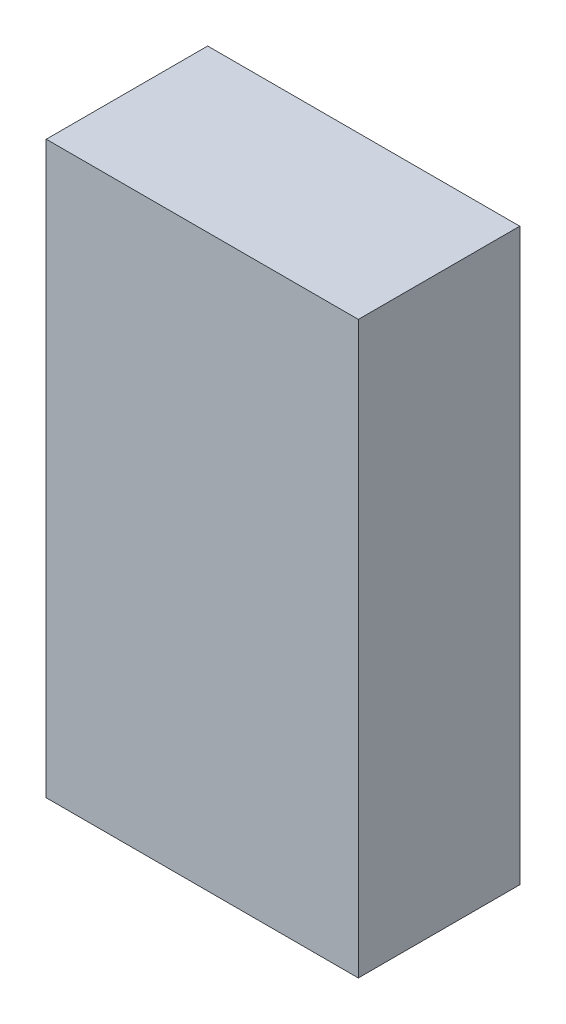
ISO-10303-21;
HEADER;
FILE_DESCRIPTION(('STEP AP214'),'2;1');
FILE_NAME('part.step','',(''),(''),'','','');
FILE_SCHEMA(('AUTOMOTIVE_DESIGN { 1 0 10303 214 1 1 1 1 }'));
ENDSEC;
DATA;
#1=APPLICATION_CONTEXT('core data for automotive mechanical design processes');
#2=APPLICATION_PROTOCOL_DEFINITION('international standard','automotive_design',2000,#1);
#3=PRODUCT_CONTEXT('',#1,'mechanical');
#4=PRODUCT('Part','Part','',(#3));
#5=PRODUCT_RELATED_PRODUCT_CATEGORY('part','',(#4));
#6=PRODUCT_DEFINITION_FORMATION('','',#4);
#7=PRODUCT_DEFINITION_CONTEXT('part definition',#1,'design');
#8=PRODUCT_DEFINITION('design','',#6,#7);
#9=PRODUCT_DEFINITION_SHAPE('','',#8);
#10=(LENGTH_UNIT() NAMED_UNIT(*) SI_UNIT(.MILLI.,.METRE.));
#11=(NAMED_UNIT(*) PLANE_ANGLE_UNIT() SI_UNIT($,.RADIAN.));
#12=(NAMED_UNIT(*) SI_UNIT($,.STERADIAN.) SOLID_ANGLE_UNIT());
#13=UNCERTAINTY_MEASURE_WITH_UNIT(LENGTH_MEASURE(1.E-05),#10,'distance_accuracy_value','');
#14=(GEOMETRIC_REPRESENTATION_CONTEXT(3) GLOBAL_UNCERTAINTY_ASSIGNED_CONTEXT((#13)) GLOBAL_UNIT_ASSIGNED_CONTEXT((#10,
#11,#12)) REPRESENTATION_CONTEXT('',''));
#15=CARTESIAN_POINT('',(0.,0.,0.));
#16=DIRECTION('',(0.,0.,1.));
#17=DIRECTION('',(1.,0.,0.));
#18=AXIS2_PLACEMENT_3D('',#15,#16,#17);
#19=CARTESIAN_POINT('',(54.859936,60.836048,1.49352));
#20=DIRECTION('',(0.,0.,1.));
#21=DIRECTION('',(0.,-1.,0.));
#22=AXIS2_PLACEMENT_3D('',#19,#20,#21);
#23=PLANE('',#22);
#24=DIRECTION('',(0.,-1.,0.));
#25=VECTOR('',#24,1.);
#26=CARTESIAN_POINT('',(56.3626,59.436,1.49352));
#27=LINE('',#26,#25);
#28=CARTESIAN_POINT('',(56.3626,58.0898,1.49352));
#29=VERTEX_POINT('',#28);
#30=CARTESIAN_POINT('',(56.3626,60.7822,1.49352));
#31=VERTEX_POINT('',#30);
#32=EDGE_CURVE('E77',#29,#31,#27,.F.);
#33=ORIENTED_EDGE('',*,*,#32,.T.);
#34=DIRECTION('',(-1.,0.,0.));
#35=VECTOR('',#34,1.);
#36=CARTESIAN_POINT('',(55.626,60.7822,1.49352));
#37=LINE('',#36,#35);
#38=CARTESIAN_POINT('',(54.8894,60.7822,1.49352));
#39=VERTEX_POINT('',#38);
#40=EDGE_CURVE('E20',#39,#31,#37,.F.);
#41=ORIENTED_EDGE('',*,*,#40,.F.);
#42=DIRECTION('',(0.,1.,0.));
#43=VECTOR('',#42,1.);
#44=CARTESIAN_POINT('',(54.8894,59.436,1.49352));
#45=LINE('',#44,#43);
#46=CARTESIAN_POINT('',(54.8894,58.0898,1.49352));
#47=VERTEX_POINT('',#46);
#48=EDGE_CURVE('E58',#39,#47,#45,.F.);
#49=ORIENTED_EDGE('',*,*,#48,.T.);
#50=DIRECTION('',(-1.,0.,0.));
#51=VECTOR('',#50,1.);
#52=CARTESIAN_POINT('',(55.626,58.0898,1.49352));
#53=LINE('',#52,#51);
#54=EDGE_CURVE('E55',#47,#29,#53,.F.);
#55=ORIENTED_EDGE('',*,*,#54,.T.);
#56=EDGE_LOOP('',(#33,#41,#49,#55));
#57=FACE_BOUND('',#56,.T.);
#58=ADVANCED_FACE('F16',(#57),#23,.T.);
#59=CARTESIAN_POINT('',(54.8894,60.836048,0.71628));
#60=DIRECTION('',(-1.,0.,0.));
#61=DIRECTION('',(0.,-1.,0.));
#62=AXIS2_PLACEMENT_3D('',#59,#60,#61);
#63=PLANE('',#62);
#64=ORIENTED_EDGE('',*,*,#48,.F.);
#65=DIRECTION('',(0.,0.,1.));
#66=VECTOR('',#65,1.);
#67=CARTESIAN_POINT('',(54.8894,60.7822,1.11252));
#68=LINE('',#67,#66);
#69=CARTESIAN_POINT('',(54.8894,60.7822,0.73152));
#70=VERTEX_POINT('',#69);
#71=EDGE_CURVE('E80',#39,#70,#68,.F.);
#72=ORIENTED_EDGE('',*,*,#71,.T.);
#73=DIRECTION('',(0.,-1.,0.));
#74=VECTOR('',#73,1.);
#75=CARTESIAN_POINT('',(54.8894,59.436,0.73152));
#76=LINE('',#75,#74);
#77=CARTESIAN_POINT('',(54.8894,58.0898,0.73152));
#78=VERTEX_POINT('',#77);
#79=EDGE_CURVE('E73',#70,#78,#76,.T.);
#80=ORIENTED_EDGE('',*,*,#79,.T.);
#81=DIRECTION('',(0.,0.,-1.));
#82=VECTOR('',#81,1.);
#83=CARTESIAN_POINT('',(54.8894,58.0898,1.11252));
#84=LINE('',#83,#82);
#85=EDGE_CURVE('E63',#78,#47,#84,.F.);
#86=ORIENTED_EDGE('',*,*,#85,.T.);
#87=EDGE_LOOP('',(#64,#72,#80,#86));
#88=FACE_BOUND('',#87,.T.);
#89=ADVANCED_FACE('F72',(#88),#63,.T.);
#90=CARTESIAN_POINT('',(54.859936,58.0898,0.71628));
#91=DIRECTION('',(0.,-1.,0.));
#92=DIRECTION('',(1.,0.,0.));
#93=AXIS2_PLACEMENT_3D('',#90,#91,#92);
#94=PLANE('',#93);
#95=ORIENTED_EDGE('',*,*,#54,.F.);
#96=ORIENTED_EDGE('',*,*,#85,.F.);
#97=DIRECTION('',(1.,0.,0.));
#98=VECTOR('',#97,1.);
#99=CARTESIAN_POINT('',(55.626,58.0898,0.73152));
#100=LINE('',#99,#98);
#101=CARTESIAN_POINT('',(56.3626,58.0898,0.73152));
#102=VERTEX_POINT('',#101);
#103=EDGE_CURVE('E83',#78,#102,#100,.T.);
#104=ORIENTED_EDGE('',*,*,#103,.T.);
#105=DIRECTION('',(0.,0.,-1.));
#106=VECTOR('',#105,1.);
#107=CARTESIAN_POINT('',(56.3626,58.0898,1.11252));
#108=LINE('',#107,#106);
#109=EDGE_CURVE('E69',#102,#29,#108,.F.);
#110=ORIENTED_EDGE('',*,*,#109,.T.);
#111=EDGE_LOOP('',(#95,#96,#104,#110));
#112=FACE_BOUND('',#111,.T.);
#113=ADVANCED_FACE('F66',(#112),#94,.T.);
#114=CARTESIAN_POINT('',(56.3626,58.035952,0.71628));
#115=DIRECTION('',(1.,0.,0.));
#116=DIRECTION('',(0.,1.,0.));
#117=AXIS2_PLACEMENT_3D('',#114,#115,#116);
#118=PLANE('',#117);
#119=ORIENTED_EDGE('',*,*,#32,.F.);
#120=ORIENTED_EDGE('',*,*,#109,.F.);
#121=DIRECTION('',(0.,1.,0.));
#122=VECTOR('',#121,1.);
#123=CARTESIAN_POINT('',(56.3626,59.436,0.73152));
#124=LINE('',#123,#122);
#125=CARTESIAN_POINT('',(56.3626,60.7822,0.73152));
#126=VERTEX_POINT('',#125);
#127=EDGE_CURVE('E26',#102,#126,#124,.T.);
#128=ORIENTED_EDGE('',*,*,#127,.T.);
#129=DIRECTION('',(0.,0.,-1.));
#130=VECTOR('',#129,1.);
#131=CARTESIAN_POINT('',(56.3626,60.7822,1.11252));
#132=LINE('',#131,#130);
#133=EDGE_CURVE('E34',#126,#31,#132,.F.);
#134=ORIENTED_EDGE('',*,*,#133,.T.);
#135=EDGE_LOOP('',(#119,#120,#128,#134));
#136=FACE_BOUND('',#135,.T.);
#137=ADVANCED_FACE('F88',(#136),#118,.T.);
#138=CARTESIAN_POINT('',(56.392064,60.7822,0.71628));
#139=DIRECTION('',(0.,1.,0.));
#140=DIRECTION('',(-1.,0.,0.));
#141=AXIS2_PLACEMENT_3D('',#138,#139,#140);
#142=PLANE('',#141);
#143=ORIENTED_EDGE('',*,*,#40,.T.);
#144=ORIENTED_EDGE('',*,*,#133,.F.);
#145=DIRECTION('',(-1.,0.,0.));
#146=VECTOR('',#145,1.);
#147=CARTESIAN_POINT('',(55.626,60.7822,0.73152));
#148=LINE('',#147,#146);
#149=EDGE_CURVE('E11',#126,#70,#148,.T.);
#150=ORIENTED_EDGE('',*,*,#149,.T.);
#151=ORIENTED_EDGE('',*,*,#71,.F.);
#152=EDGE_LOOP('',(#143,#144,#150,#151));
#153=FACE_BOUND('',#152,.T.);
#154=ADVANCED_FACE('F90',(#153),#142,.T.);
#155=CARTESIAN_POINT('',(54.859936,60.836048,0.73152));
#156=DIRECTION('',(0.,0.,1.));
#157=DIRECTION('',(0.,-1.,0.));
#158=AXIS2_PLACEMENT_3D('',#155,#156,#157);
#159=PLANE('',#158);
#160=ORIENTED_EDGE('',*,*,#127,.F.);
#161=ORIENTED_EDGE('',*,*,#103,.F.);
#162=ORIENTED_EDGE('',*,*,#79,.F.);
#163=ORIENTED_EDGE('',*,*,#149,.F.);
#164=EDGE_LOOP('',(#160,#161,#162,#163));
#165=FACE_BOUND('',#164,.T.);
#166=ADVANCED_FACE('F18',(#165),#159,.F.);
#167=CLOSED_SHELL('',(#58,#89,#113,#137,#154,#166));
#168=MANIFOLD_SOLID_BREP('B1',#167);
#169=ADVANCED_BREP_SHAPE_REPRESENTATION('',(#18,#168),#14);
#170=SHAPE_DEFINITION_REPRESENTATION(#9,#169);
ENDSEC;
END-ISO-10303-21;
